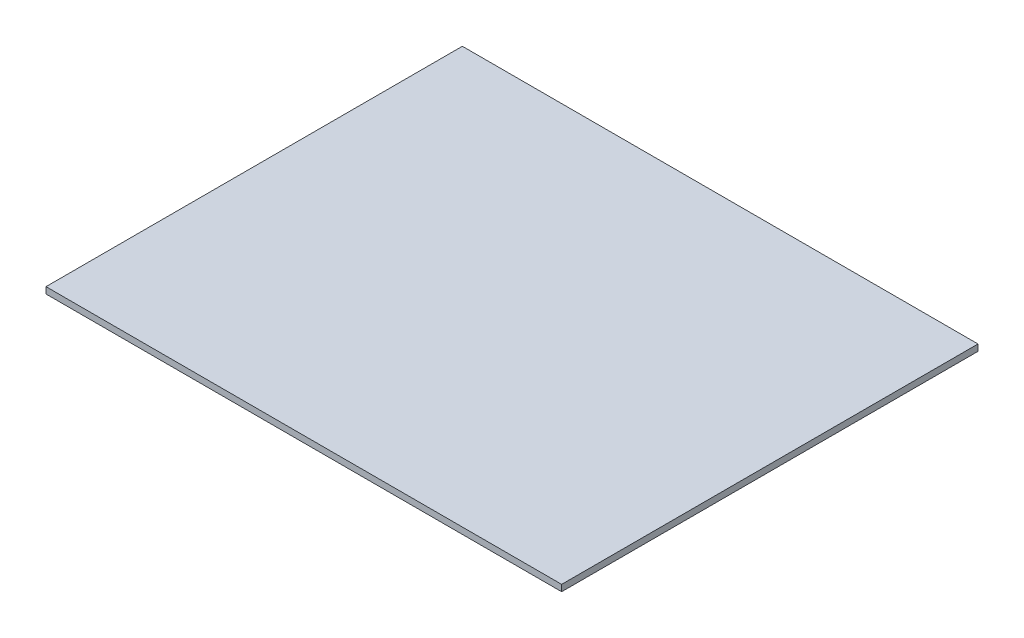
ISO-10303-21;
HEADER;
FILE_DESCRIPTION(('STEP AP214'),'2;1');
FILE_NAME('part.step','',(''),(''),'','','');
FILE_SCHEMA(('AUTOMOTIVE_DESIGN { 1 0 10303 214 1 1 1 1 }'));
ENDSEC;
DATA;
#1=APPLICATION_CONTEXT('core data for automotive mechanical design processes');
#2=APPLICATION_PROTOCOL_DEFINITION('international standard','automotive_design',2000,#1);
#3=PRODUCT_CONTEXT('',#1,'mechanical');
#4=PRODUCT('Part','Part','',(#3));
#5=PRODUCT_RELATED_PRODUCT_CATEGORY('part','',(#4));
#6=PRODUCT_DEFINITION_FORMATION('','',#4);
#7=PRODUCT_DEFINITION_CONTEXT('part definition',#1,'design');
#8=PRODUCT_DEFINITION('design','',#6,#7);
#9=PRODUCT_DEFINITION_SHAPE('','',#8);
#10=(LENGTH_UNIT() NAMED_UNIT(*) SI_UNIT(.MILLI.,.METRE.));
#11=(NAMED_UNIT(*) PLANE_ANGLE_UNIT() SI_UNIT($,.RADIAN.));
#12=(NAMED_UNIT(*) SI_UNIT($,.STERADIAN.) SOLID_ANGLE_UNIT());
#13=UNCERTAINTY_MEASURE_WITH_UNIT(LENGTH_MEASURE(1.E-05),#10,'distance_accuracy_value','');
#14=(GEOMETRIC_REPRESENTATION_CONTEXT(3) GLOBAL_UNCERTAINTY_ASSIGNED_CONTEXT((#13)) GLOBAL_UNIT_ASSIGNED_CONTEXT((#10,
#11,#12)) REPRESENTATION_CONTEXT('',''));
#15=CARTESIAN_POINT('',(0.,0.,0.));
#16=DIRECTION('',(0.,0.,1.));
#17=DIRECTION('',(1.,0.,0.));
#18=AXIS2_PLACEMENT_3D('',#15,#16,#17);
#19=CARTESIAN_POINT('',(62.5,10.,0.));
#20=DIRECTION('',(-1.,0.,0.));
#21=DIRECTION('',(0.,0.,1.));
#22=AXIS2_PLACEMENT_3D('',#19,#20,#21);
#23=PLANE('',#22);
#24=DIRECTION('',(0.,0.,-1.));
#25=VECTOR('',#24,1.);
#26=CARTESIAN_POINT('',(62.5,10.,0.));
#27=LINE('',#26,#25);
#28=CARTESIAN_POINT('',(62.5,10.,39.));
#29=VERTEX_POINT('',#28);
#30=CARTESIAN_POINT('',(62.5,10.,-47.));
#31=VERTEX_POINT('',#30);
#32=EDGE_CURVE('E180',#29,#31,#27,.T.);
#33=ORIENTED_EDGE('',*,*,#32,.F.);
#34=DIRECTION('',(0.,-1.,0.));
#35=VECTOR('',#34,1.);
#36=CARTESIAN_POINT('',(62.5,16.3245553203368,39.));
#37=LINE('',#36,#35);
#38=CARTESIAN_POINT('',(62.5,0.,39.));
#39=VERTEX_POINT('',#38);
#40=EDGE_CURVE('E186',#29,#39,#37,.T.);
#41=ORIENTED_EDGE('',*,*,#40,.T.);
#42=DIRECTION('',(0.,0.,-1.));
#43=VECTOR('',#42,1.);
#44=CARTESIAN_POINT('',(62.5,0.,0.));
#45=LINE('',#44,#43);
#46=CARTESIAN_POINT('',(62.5,0.,-47.));
#47=VERTEX_POINT('',#46);
#48=EDGE_CURVE('E137',#39,#47,#45,.T.);
#49=ORIENTED_EDGE('',*,*,#48,.T.);
#50=DIRECTION('',(0.,-1.,0.));
#51=VECTOR('',#50,1.);
#52=CARTESIAN_POINT('',(62.5,10.,-47.));
#53=LINE('',#52,#51);
#54=EDGE_CURVE('E169',#31,#47,#53,.T.);
#55=ORIENTED_EDGE('',*,*,#54,.F.);
#56=EDGE_LOOP('',(#33,#41,#49,#55));
#57=FACE_BOUND('',#56,.T.);
#58=ADVANCED_FACE('F56',(#57),#23,.F.);
#59=CARTESIAN_POINT('',(-60.5,10.,0.));
#60=DIRECTION('',(-1.,0.,0.));
#61=DIRECTION('',(0.,0.,1.));
#62=AXIS2_PLACEMENT_3D('',#59,#60,#61);
#63=PLANE('',#62);
#64=DIRECTION('',(0.,0.,-1.));
#65=VECTOR('',#64,1.);
#66=CARTESIAN_POINT('',(-60.5,10.,0.));
#67=LINE('',#66,#65);
#68=CARTESIAN_POINT('',(-60.5,10.,39.));
#69=VERTEX_POINT('',#68);
#70=CARTESIAN_POINT('',(-60.5,10.,-7.));
#71=VERTEX_POINT('',#70);
#72=EDGE_CURVE('E164',#69,#71,#67,.T.);
#73=ORIENTED_EDGE('',*,*,#72,.F.);
#74=DIRECTION('',(0.,-1.,0.));
#75=VECTOR('',#74,1.);
#76=CARTESIAN_POINT('',(-60.5,16.3245553203368,39.));
#77=LINE('',#76,#75);
#78=CARTESIAN_POINT('',(-60.5,0.,39.));
#79=VERTEX_POINT('',#78);
#80=EDGE_CURVE('E157',#69,#79,#77,.T.);
#81=ORIENTED_EDGE('',*,*,#80,.T.);
#82=DIRECTION('',(0.,0.,-1.));
#83=VECTOR('',#82,1.);
#84=CARTESIAN_POINT('',(-60.5,0.,0.));
#85=LINE('',#84,#83);
#86=CARTESIAN_POINT('',(-60.5,0.,-7.));
#87=VERTEX_POINT('',#86);
#88=EDGE_CURVE('E156',#79,#87,#85,.T.);
#89=ORIENTED_EDGE('',*,*,#88,.T.);
#90=DIRECTION('',(0.,-1.,0.));
#91=VECTOR('',#90,1.);
#92=CARTESIAN_POINT('',(-60.5,10.,-7.));
#93=LINE('',#92,#91);
#94=EDGE_CURVE('E155',#71,#87,#93,.T.);
#95=ORIENTED_EDGE('',*,*,#94,.F.);
#96=EDGE_LOOP('',(#73,#81,#89,#95));
#97=FACE_BOUND('',#96,.T.);
#98=ADVANCED_FACE('F217',(#97),#63,.F.);
#99=CARTESIAN_POINT('',(0.,10.,-7.));
#100=DIRECTION('',(0.,0.,-1.));
#101=DIRECTION('',(-1.,0.,0.));
#102=AXIS2_PLACEMENT_3D('',#99,#100,#101);
#103=PLANE('',#102);
#104=DIRECTION('',(1.,0.,0.));
#105=VECTOR('',#104,1.);
#106=CARTESIAN_POINT('',(0.,0.,-7.));
#107=LINE('',#106,#105);
#108=CARTESIAN_POINT('',(60.5,0.,-7.));
#109=VERTEX_POINT('',#108);
#110=EDGE_CURVE('E153',#87,#109,#107,.T.);
#111=ORIENTED_EDGE('',*,*,#110,.T.);
#112=DIRECTION('',(0.,-1.,0.));
#113=VECTOR('',#112,1.);
#114=CARTESIAN_POINT('',(60.5,10.,-7.));
#115=LINE('',#114,#113);
#116=CARTESIAN_POINT('',(60.5,10.,-7.));
#117=VERTEX_POINT('',#116);
#118=EDGE_CURVE('E141',#117,#109,#115,.T.);
#119=ORIENTED_EDGE('',*,*,#118,.F.);
#120=DIRECTION('',(1.,0.,0.));
#121=VECTOR('',#120,1.);
#122=CARTESIAN_POINT('',(0.,10.,-7.));
#123=LINE('',#122,#121);
#124=EDGE_CURVE('E161',#71,#117,#123,.T.);
#125=ORIENTED_EDGE('',*,*,#124,.F.);
#126=ORIENTED_EDGE('',*,*,#94,.T.);
#127=EDGE_LOOP('',(#111,#119,#125,#126));
#128=FACE_BOUND('',#127,.T.);
#129=ADVANCED_FACE('F214',(#128),#103,.F.);
#130=CARTESIAN_POINT('',(60.5,10.,0.));
#131=DIRECTION('',(-1.,0.,0.));
#132=DIRECTION('',(0.,0.,1.));
#133=AXIS2_PLACEMENT_3D('',#130,#131,#132);
#134=PLANE('',#133);
#135=DIRECTION('',(0.,-1.,0.));
#136=VECTOR('',#135,1.);
#137=CARTESIAN_POINT('',(60.5,16.3245553203368,39.));
#138=LINE('',#137,#136);
#139=CARTESIAN_POINT('',(60.5,10.,39.));
#140=VERTEX_POINT('',#139);
#141=CARTESIAN_POINT('',(60.5,0.,39.));
#142=VERTEX_POINT('',#141);
#143=EDGE_CURVE('E117',#140,#142,#138,.T.);
#144=ORIENTED_EDGE('',*,*,#143,.F.);
#145=DIRECTION('',(0.,0.,-1.));
#146=VECTOR('',#145,1.);
#147=CARTESIAN_POINT('',(60.5,10.,0.));
#148=LINE('',#147,#146);
#149=EDGE_CURVE('E159',#140,#117,#148,.T.);
#150=ORIENTED_EDGE('',*,*,#149,.T.);
#151=ORIENTED_EDGE('',*,*,#118,.T.);
#152=DIRECTION('',(0.,0.,-1.));
#153=VECTOR('',#152,1.);
#154=CARTESIAN_POINT('',(60.5,0.,0.));
#155=LINE('',#154,#153);
#156=EDGE_CURVE('E134',#142,#109,#155,.T.);
#157=ORIENTED_EDGE('',*,*,#156,.F.);
#158=EDGE_LOOP('',(#144,#150,#151,#157));
#159=FACE_BOUND('',#158,.T.);
#160=ADVANCED_FACE('F139',(#159),#134,.T.);
#161=CARTESIAN_POINT('',(-62.5,10.,0.));
#162=DIRECTION('',(-1.,0.,0.));
#163=DIRECTION('',(0.,0.,1.));
#164=AXIS2_PLACEMENT_3D('',#161,#162,#163);
#165=PLANE('',#164);
#166=DIRECTION('',(0.,-1.,0.));
#167=VECTOR('',#166,1.);
#168=CARTESIAN_POINT('',(-62.5,16.3245553203368,39.));
#169=LINE('',#168,#167);
#170=CARTESIAN_POINT('',(-62.5,10.,39.));
#171=VERTEX_POINT('',#170);
#172=CARTESIAN_POINT('',(-62.5,0.,39.));
#173=VERTEX_POINT('',#172);
#174=EDGE_CURVE('E66',#171,#173,#169,.T.);
#175=ORIENTED_EDGE('',*,*,#174,.F.);
#176=DIRECTION('',(0.,0.,-1.));
#177=VECTOR('',#176,1.);
#178=CARTESIAN_POINT('',(-62.5,10.,0.));
#179=LINE('',#178,#177);
#180=CARTESIAN_POINT('',(-62.5,10.,-47.));
#181=VERTEX_POINT('',#180);
#182=EDGE_CURVE('E193',#171,#181,#179,.T.);
#183=ORIENTED_EDGE('',*,*,#182,.T.);
#184=DIRECTION('',(0.,-1.,0.));
#185=VECTOR('',#184,1.);
#186=CARTESIAN_POINT('',(-62.5,10.,-47.));
#187=LINE('',#186,#185);
#188=CARTESIAN_POINT('',(-62.5,0.,-47.));
#189=VERTEX_POINT('',#188);
#190=EDGE_CURVE('E170',#181,#189,#187,.T.);
#191=ORIENTED_EDGE('',*,*,#190,.T.);
#192=DIRECTION('',(0.,0.,-1.));
#193=VECTOR('',#192,1.);
#194=CARTESIAN_POINT('',(-62.5,0.,0.));
#195=LINE('',#194,#193);
#196=EDGE_CURVE('E60',#173,#189,#195,.T.);
#197=ORIENTED_EDGE('',*,*,#196,.F.);
#198=EDGE_LOOP('',(#175,#183,#191,#197));
#199=FACE_BOUND('',#198,.T.);
#200=ADVANCED_FACE('F58',(#199),#165,.T.);
#201=CARTESIAN_POINT('',(0.,10.,-47.));
#202=DIRECTION('',(0.,0.,-1.));
#203=DIRECTION('',(-1.,0.,0.));
#204=AXIS2_PLACEMENT_3D('',#201,#202,#203);
#205=PLANE('',#204);
#206=DIRECTION('',(1.,0.,0.));
#207=VECTOR('',#206,1.);
#208=CARTESIAN_POINT('',(0.,0.,-47.));
#209=LINE('',#208,#207);
#210=EDGE_CURVE('E144',#189,#47,#209,.T.);
#211=ORIENTED_EDGE('',*,*,#210,.F.);
#212=ORIENTED_EDGE('',*,*,#190,.F.);
#213=DIRECTION('',(1.,0.,0.));
#214=VECTOR('',#213,1.);
#215=CARTESIAN_POINT('',(0.,10.,-47.));
#216=LINE('',#215,#214);
#217=EDGE_CURVE('E166',#181,#31,#216,.T.);
#218=ORIENTED_EDGE('',*,*,#217,.T.);
#219=ORIENTED_EDGE('',*,*,#54,.T.);
#220=EDGE_LOOP('',(#211,#212,#218,#219));
#221=FACE_BOUND('',#220,.T.);
#222=ADVANCED_FACE('F200',(#221),#205,.T.);
#223=CARTESIAN_POINT('',(0.,10.,0.));
#224=DIRECTION('',(0.,1.,0.));
#225=DIRECTION('',(0.,0.,1.));
#226=AXIS2_PLACEMENT_3D('',#223,#224,#225);
#227=PLANE('',#226);
#228=DIRECTION('',(1.,0.,0.));
#229=VECTOR('',#228,1.);
#230=CARTESIAN_POINT('',(-60.5,10.,39.));
#231=LINE('',#230,#229);
#232=EDGE_CURVE('E75',#171,#69,#231,.T.);
#233=ORIENTED_EDGE('',*,*,#232,.T.);
#234=ORIENTED_EDGE('',*,*,#72,.T.);
#235=ORIENTED_EDGE('',*,*,#124,.T.);
#236=ORIENTED_EDGE('',*,*,#149,.F.);
#237=DIRECTION('',(1.,0.,0.));
#238=VECTOR('',#237,1.);
#239=CARTESIAN_POINT('',(60.5,10.,39.));
#240=LINE('',#239,#238);
#241=EDGE_CURVE('E123',#140,#29,#240,.T.);
#242=ORIENTED_EDGE('',*,*,#241,.T.);
#243=ORIENTED_EDGE('',*,*,#32,.T.);
#244=ORIENTED_EDGE('',*,*,#217,.F.);
#245=ORIENTED_EDGE('',*,*,#182,.F.);
#246=EDGE_LOOP('',(#233,#234,#235,#236,#242,#243,#244,#245));
#247=FACE_BOUND('',#246,.T.);
#248=ADVANCED_FACE('F220',(#247),#227,.T.);
#249=CARTESIAN_POINT('',(0.,0.,0.));
#250=DIRECTION('',(0.,1.,0.));
#251=DIRECTION('',(0.,0.,1.));
#252=AXIS2_PLACEMENT_3D('',#249,#250,#251);
#253=PLANE('',#252);
#254=CARTESIAN_POINT('',(50.,0.,-35.));
#255=DIRECTION('',(0.,1.,0.));
#256=DIRECTION('',(0.,0.,-1.));
#257=AXIS2_PLACEMENT_3D('',#254,#255,#256);
#258=CIRCLE('',#257,3.5);
#259=CARTESIAN_POINT('',(50.,0.,-38.5));
#260=VERTEX_POINT('',#259);
#261=EDGE_CURVE('E177',#260,#260,#258,.T.);
#262=ORIENTED_EDGE('',*,*,#261,.T.);
#263=EDGE_LOOP('',(#262));
#264=FACE_BOUND('',#263,.T.);
#265=CARTESIAN_POINT('',(-50.,0.,-35.));
#266=DIRECTION('',(0.,1.,0.));
#267=DIRECTION('',(0.,0.,1.));
#268=AXIS2_PLACEMENT_3D('',#265,#266,#267);
#269=CIRCLE('',#268,3.5);
#270=CARTESIAN_POINT('',(-50.,0.,-31.5));
#271=VERTEX_POINT('',#270);
#272=EDGE_CURVE('E143',#271,#271,#269,.F.);
#273=ORIENTED_EDGE('',*,*,#272,.F.);
#274=EDGE_LOOP('',(#273));
#275=FACE_BOUND('',#274,.T.);
#276=ORIENTED_EDGE('',*,*,#88,.F.);
#277=DIRECTION('',(1.,0.,0.));
#278=VECTOR('',#277,1.);
#279=CARTESIAN_POINT('',(-60.5,0.,39.));
#280=LINE('',#279,#278);
#281=EDGE_CURVE('E12',#173,#79,#280,.T.);
#282=ORIENTED_EDGE('',*,*,#281,.F.);
#283=ORIENTED_EDGE('',*,*,#196,.T.);
#284=ORIENTED_EDGE('',*,*,#210,.T.);
#285=ORIENTED_EDGE('',*,*,#48,.F.);
#286=DIRECTION('',(1.,0.,0.));
#287=VECTOR('',#286,1.);
#288=CARTESIAN_POINT('',(60.5,0.,39.));
#289=LINE('',#288,#287);
#290=EDGE_CURVE('E120',#142,#39,#289,.T.);
#291=ORIENTED_EDGE('',*,*,#290,.F.);
#292=ORIENTED_EDGE('',*,*,#156,.T.);
#293=ORIENTED_EDGE('',*,*,#110,.F.);
#294=EDGE_LOOP('',(#276,#282,#283,#284,#285,#291,#292,#293));
#295=FACE_BOUND('',#294,.T.);
#296=ADVANCED_FACE('F132',(#264,#275,#295),#253,.F.);
#297=CARTESIAN_POINT('',(-50.,-4.2,-35.));
#298=DIRECTION('',(0.,1.,0.));
#299=DIRECTION('',(0.,0.,1.));
#300=AXIS2_PLACEMENT_3D('',#297,#298,#299);
#301=CYLINDRICAL_SURFACE('',#300,3.5);
#302=CARTESIAN_POINT('',(-50.,-4.2,-35.));
#303=DIRECTION('',(0.,-1.,0.));
#304=DIRECTION('',(0.,0.,-1.));
#305=AXIS2_PLACEMENT_3D('',#302,#303,#304);
#306=CIRCLE('',#305,3.5);
#307=CARTESIAN_POINT('',(-50.,-4.2,-38.5));
#308=VERTEX_POINT('',#307);
#309=EDGE_CURVE('E171',#308,#308,#306,.T.);
#310=ORIENTED_EDGE('',*,*,#309,.F.);
#311=EDGE_LOOP('',(#310));
#312=FACE_BOUND('',#311,.T.);
#313=ORIENTED_EDGE('',*,*,#272,.T.);
#314=EDGE_LOOP('',(#313));
#315=FACE_BOUND('',#314,.T.);
#316=ADVANCED_FACE('F227',(#312,#315),#301,.T.);
#317=CARTESIAN_POINT('',(-50.,2.94142842854285,-35.));
#318=DIRECTION('',(0.,-1.,0.));
#319=DIRECTION('',(-1.,0.,0.));
#320=AXIS2_PLACEMENT_3D('',#317,#318,#319);
#321=SPHERICAL_SURFACE('',#320,10.);
#322=CARTESIAN_POINT('',(-50.,-4.2,-35.));
#323=DIRECTION('',(0.,-1.,0.));
#324=DIRECTION('',(0.,0.,-1.));
#325=AXIS2_PLACEMENT_3D('',#322,#323,#324);
#326=CIRCLE('',#325,7.);
#327=CARTESIAN_POINT('',(-50.,-4.2,-42.));
#328=VERTEX_POINT('',#327);
#329=EDGE_CURVE('E147',#328,#328,#326,.T.);
#330=ORIENTED_EDGE('',*,*,#329,.T.);
#331=EDGE_LOOP('',(#330));
#332=FACE_BOUND('',#331,.T.);
#333=ADVANCED_FACE('F246',(#332),#321,.T.);
#334=CARTESIAN_POINT('',(0.,-4.2,-35.));
#335=DIRECTION('',(0.,-1.,0.));
#336=DIRECTION('',(0.,0.,-1.));
#337=AXIS2_PLACEMENT_3D('',#334,#335,#336);
#338=PLANE('',#337);
#339=ORIENTED_EDGE('',*,*,#309,.T.);
#340=EDGE_LOOP('',(#339));
#341=FACE_BOUND('',#340,.T.);
#342=ORIENTED_EDGE('',*,*,#329,.F.);
#343=EDGE_LOOP('',(#342));
#344=FACE_BOUND('',#343,.T.);
#345=ADVANCED_FACE('F250',(#341,#344),#338,.F.);
#346=CARTESIAN_POINT('',(50.,-4.2,-35.));
#347=DIRECTION('',(0.,1.,0.));
#348=DIRECTION('',(0.,0.,1.));
#349=AXIS2_PLACEMENT_3D('',#346,#347,#348);
#350=CYLINDRICAL_SURFACE('',#349,3.5);
#351=CARTESIAN_POINT('',(50.,-4.2,-35.));
#352=DIRECTION('',(0.,-1.,0.));
#353=DIRECTION('',(0.,0.,-1.));
#354=AXIS2_PLACEMENT_3D('',#351,#352,#353);
#355=CIRCLE('',#354,3.5);
#356=CARTESIAN_POINT('',(50.,-4.2,-38.5));
#357=VERTEX_POINT('',#356);
#358=EDGE_CURVE('E174',#357,#357,#355,.F.);
#359=ORIENTED_EDGE('',*,*,#358,.T.);
#360=EDGE_LOOP('',(#359));
#361=FACE_BOUND('',#360,.T.);
#362=ORIENTED_EDGE('',*,*,#261,.F.);
#363=EDGE_LOOP('',(#362));
#364=FACE_BOUND('',#363,.T.);
#365=ADVANCED_FACE('F254',(#361,#364),#350,.T.);
#366=CARTESIAN_POINT('',(50.,2.94142842854285,-35.));
#367=DIRECTION('',(0.,-1.,0.));
#368=DIRECTION('',(1.,0.,0.));
#369=AXIS2_PLACEMENT_3D('',#366,#367,#368);
#370=SPHERICAL_SURFACE('',#369,10.);
#371=CARTESIAN_POINT('',(50.,-4.2,-35.));
#372=DIRECTION('',(0.,1.,0.));
#373=DIRECTION('',(0.,0.,-1.));
#374=AXIS2_PLACEMENT_3D('',#371,#372,#373);
#375=CIRCLE('',#374,7.);
#376=CARTESIAN_POINT('',(50.,-4.2,-42.));
#377=VERTEX_POINT('',#376);
#378=EDGE_CURVE('E127',#377,#377,#375,.T.);
#379=ORIENTED_EDGE('',*,*,#378,.F.);
#380=EDGE_LOOP('',(#379));
#381=FACE_BOUND('',#380,.T.);
#382=ADVANCED_FACE('F258',(#381),#370,.T.);
#383=CARTESIAN_POINT('',(0.,-4.2,-35.));
#384=DIRECTION('',(0.,-1.,0.));
#385=DIRECTION('',(0.,0.,-1.));
#386=AXIS2_PLACEMENT_3D('',#383,#384,#385);
#387=PLANE('',#386);
#388=ORIENTED_EDGE('',*,*,#358,.F.);
#389=EDGE_LOOP('',(#388));
#390=FACE_BOUND('',#389,.T.);
#391=ORIENTED_EDGE('',*,*,#378,.T.);
#392=EDGE_LOOP('',(#391));
#393=FACE_BOUND('',#392,.T.);
#394=ADVANCED_FACE('F262',(#390,#393),#387,.F.);
#395=CARTESIAN_POINT('',(60.5,16.3245553203368,39.));
#396=DIRECTION('',(0.,0.,-1.));
#397=DIRECTION('',(-1.,0.,0.));
#398=AXIS2_PLACEMENT_3D('',#395,#396,#397);
#399=PLANE('',#398);
#400=ORIENTED_EDGE('',*,*,#143,.T.);
#401=ORIENTED_EDGE('',*,*,#290,.T.);
#402=ORIENTED_EDGE('',*,*,#40,.F.);
#403=ORIENTED_EDGE('',*,*,#241,.F.);
#404=EDGE_LOOP('',(#400,#401,#402,#403));
#405=FACE_BOUND('',#404,.T.);
#406=ADVANCED_FACE('F119',(#405),#399,.F.);
#407=CARTESIAN_POINT('',(-60.5,16.3245553203368,39.));
#408=DIRECTION('',(0.,0.,-1.));
#409=DIRECTION('',(-1.,0.,0.));
#410=AXIS2_PLACEMENT_3D('',#407,#408,#409);
#411=PLANE('',#410);
#412=ORIENTED_EDGE('',*,*,#174,.T.);
#413=ORIENTED_EDGE('',*,*,#281,.T.);
#414=ORIENTED_EDGE('',*,*,#80,.F.);
#415=ORIENTED_EDGE('',*,*,#232,.F.);
#416=EDGE_LOOP('',(#412,#413,#414,#415));
#417=FACE_BOUND('',#416,.T.);
#418=ADVANCED_FACE('F218',(#417),#411,.F.);
#419=CLOSED_SHELL('',(#58,#98,#129,#160,#200,#222,#248,#296,#316,#333,#345,#365,#382,#394,#406,#418));
#420=MANIFOLD_SOLID_BREP('B2',#419);
#421=CARTESIAN_POINT('',(-400000.,12.,-64.9999999999409));
#422=DIRECTION('',(0.,0.,1.));
#423=DIRECTION('',(1.,0.,0.));
#424=AXIS2_PLACEMENT_3D('',#421,#422,#423);
#425=PLANE('',#424);
#426=DIRECTION('',(-1.,0.,0.));
#427=VECTOR('',#426,1.);
#428=CARTESIAN_POINT('',(-400000.,10.,-64.9999999999409));
#429=LINE('',#428,#427);
#430=CARTESIAN_POINT('',(80.4999999999723,10.,-64.9999999999977));
#431=VERTEX_POINT('',#430);
#432=CARTESIAN_POINT('',(-80.4999999999723,10.,-64.9999999999977));
#433=VERTEX_POINT('',#432);
#434=EDGE_CURVE('E446',#431,#433,#429,.T.);
#435=ORIENTED_EDGE('',*,*,#434,.T.);
#436=DIRECTION('',(0.,-1.,0.));
#437=VECTOR('',#436,1.);
#438=CARTESIAN_POINT('',(-80.4999999999723,12.,-64.9999999999977));
#439=LINE('',#438,#437);
#440=CARTESIAN_POINT('',(-80.4999999999723,12.,-64.9999999999977));
#441=VERTEX_POINT('',#440);
#442=EDGE_CURVE('E54',#441,#433,#439,.T.);
#443=ORIENTED_EDGE('',*,*,#442,.F.);
#444=DIRECTION('',(-1.,0.,0.));
#445=VECTOR('',#444,1.);
#446=CARTESIAN_POINT('',(-400000.,12.,-64.9999999999409));
#447=LINE('',#446,#445);
#448=CARTESIAN_POINT('',(80.4999999999723,12.,-64.9999999999977));
#449=VERTEX_POINT('',#448);
#450=EDGE_CURVE('E432',#449,#441,#447,.T.);
#451=ORIENTED_EDGE('',*,*,#450,.F.);
#452=DIRECTION('',(0.,-1.,0.));
#453=VECTOR('',#452,1.);
#454=CARTESIAN_POINT('',(80.4999999999723,12.,-64.9999999999977));
#455=LINE('',#454,#453);
#456=EDGE_CURVE('E399',#449,#431,#455,.T.);
#457=ORIENTED_EDGE('',*,*,#456,.T.);
#458=EDGE_LOOP('',(#435,#443,#451,#457));
#459=FACE_BOUND('',#458,.T.);
#460=ADVANCED_FACE('F383',(#459),#425,.F.);
#461=CARTESIAN_POINT('',(-80.4999999999723,12.,291548.3));
#462=DIRECTION('',(1.,0.,0.));
#463=DIRECTION('',(0.,0.,-1.));
#464=AXIS2_PLACEMENT_3D('',#461,#462,#463);
#465=PLANE('',#464);
#466=DIRECTION('',(0.,0.,1.));
#467=VECTOR('',#466,1.);
#468=CARTESIAN_POINT('',(-80.4999999999723,10.,291548.3));
#469=LINE('',#468,#467);
#470=CARTESIAN_POINT('',(-80.4999999999723,10.,64.9999999999977));
#471=VERTEX_POINT('',#470);
#472=EDGE_CURVE('E437',#433,#471,#469,.T.);
#473=ORIENTED_EDGE('',*,*,#472,.T.);
#474=DIRECTION('',(0.,-1.,0.));
#475=VECTOR('',#474,1.);
#476=CARTESIAN_POINT('',(-80.4999999999723,12.,64.9999999999977));
#477=LINE('',#476,#475);
#478=CARTESIAN_POINT('',(-80.4999999999723,12.,64.9999999999977));
#479=VERTEX_POINT('',#478);
#480=EDGE_CURVE('E391',#479,#471,#477,.T.);
#481=ORIENTED_EDGE('',*,*,#480,.F.);
#482=DIRECTION('',(0.,0.,1.));
#483=VECTOR('',#482,1.);
#484=CARTESIAN_POINT('',(-80.4999999999723,12.,291548.3));
#485=LINE('',#484,#483);
#486=EDGE_CURVE('E424',#441,#479,#485,.T.);
#487=ORIENTED_EDGE('',*,*,#486,.F.);
#488=ORIENTED_EDGE('',*,*,#442,.T.);
#489=EDGE_LOOP('',(#473,#481,#487,#488));
#490=FACE_BOUND('',#489,.T.);
#491=ADVANCED_FACE('F436',(#490),#465,.F.);
#492=CARTESIAN_POINT('',(-400000.,12.,64.9999999999977));
#493=DIRECTION('',(0.,0.,1.));
#494=DIRECTION('',(1.,0.,0.));
#495=AXIS2_PLACEMENT_3D('',#492,#493,#494);
#496=PLANE('',#495);
#497=DIRECTION('',(-1.,0.,0.));
#498=VECTOR('',#497,1.);
#499=CARTESIAN_POINT('',(-400000.,10.,64.9999999999977));
#500=LINE('',#499,#498);
#501=CARTESIAN_POINT('',(80.4999999999723,10.,64.9999999999977));
#502=VERTEX_POINT('',#501);
#503=EDGE_CURVE('E449',#502,#471,#500,.T.);
#504=ORIENTED_EDGE('',*,*,#503,.F.);
#505=DIRECTION('',(0.,-1.,0.));
#506=VECTOR('',#505,1.);
#507=CARTESIAN_POINT('',(80.4999999999723,12.,64.9999999999977));
#508=LINE('',#507,#506);
#509=CARTESIAN_POINT('',(80.4999999999723,12.,64.9999999999977));
#510=VERTEX_POINT('',#509);
#511=EDGE_CURVE('E413',#510,#502,#508,.T.);
#512=ORIENTED_EDGE('',*,*,#511,.F.);
#513=DIRECTION('',(-1.,0.,0.));
#514=VECTOR('',#513,1.);
#515=CARTESIAN_POINT('',(-400000.,12.,64.9999999999977));
#516=LINE('',#515,#514);
#517=EDGE_CURVE('E431',#510,#479,#516,.T.);
#518=ORIENTED_EDGE('',*,*,#517,.T.);
#519=ORIENTED_EDGE('',*,*,#480,.T.);
#520=EDGE_LOOP('',(#504,#512,#518,#519));
#521=FACE_BOUND('',#520,.T.);
#522=ADVANCED_FACE('F440',(#521),#496,.T.);
#523=CARTESIAN_POINT('',(80.4999999999723,12.,291548.3));
#524=DIRECTION('',(1.,0.,0.));
#525=DIRECTION('',(0.,0.,-1.));
#526=AXIS2_PLACEMENT_3D('',#523,#524,#525);
#527=PLANE('',#526);
#528=DIRECTION('',(0.,0.,1.));
#529=VECTOR('',#528,1.);
#530=CARTESIAN_POINT('',(80.4999999999723,10.,291548.3));
#531=LINE('',#530,#529);
#532=EDGE_CURVE('E451',#431,#502,#531,.T.);
#533=ORIENTED_EDGE('',*,*,#532,.F.);
#534=ORIENTED_EDGE('',*,*,#456,.F.);
#535=DIRECTION('',(0.,0.,1.));
#536=VECTOR('',#535,1.);
#537=CARTESIAN_POINT('',(80.4999999999723,12.,291548.3));
#538=LINE('',#537,#536);
#539=EDGE_CURVE('E441',#449,#510,#538,.T.);
#540=ORIENTED_EDGE('',*,*,#539,.T.);
#541=ORIENTED_EDGE('',*,*,#511,.T.);
#542=EDGE_LOOP('',(#533,#534,#540,#541));
#543=FACE_BOUND('',#542,.T.);
#544=ADVANCED_FACE('F457',(#543),#527,.T.);
#545=CARTESIAN_POINT('',(0.,12.,0.));
#546=DIRECTION('',(0.,1.,0.));
#547=DIRECTION('',(0.,0.,1.));
#548=AXIS2_PLACEMENT_3D('',#545,#546,#547);
#549=PLANE('',#548);
#550=ORIENTED_EDGE('',*,*,#450,.T.);
#551=ORIENTED_EDGE('',*,*,#486,.T.);
#552=ORIENTED_EDGE('',*,*,#517,.F.);
#553=ORIENTED_EDGE('',*,*,#539,.F.);
#554=EDGE_LOOP('',(#550,#551,#552,#553));
#555=FACE_BOUND('',#554,.T.);
#556=ADVANCED_FACE('F428',(#555),#549,.T.);
#557=CARTESIAN_POINT('',(0.,10.,0.));
#558=DIRECTION('',(0.,1.,0.));
#559=DIRECTION('',(0.,0.,1.));
#560=AXIS2_PLACEMENT_3D('',#557,#558,#559);
#561=PLANE('',#560);
#562=ORIENTED_EDGE('',*,*,#434,.F.);
#563=ORIENTED_EDGE('',*,*,#532,.T.);
#564=ORIENTED_EDGE('',*,*,#503,.T.);
#565=ORIENTED_EDGE('',*,*,#472,.F.);
#566=EDGE_LOOP('',(#562,#563,#564,#565));
#567=FACE_BOUND('',#566,.T.);
#568=ADVANCED_FACE('F456',(#567),#561,.F.);
#569=CLOSED_SHELL('',(#460,#491,#522,#544,#556,#568));
#570=MANIFOLD_SOLID_BREP('B6',#569);
#571=CARTESIAN_POINT('',(0.,10.,47.));
#572=DIRECTION('',(0.,0.,-1.));
#573=DIRECTION('',(-1.,0.,0.));
#574=AXIS2_PLACEMENT_3D('',#571,#572,#573);
#575=PLANE('',#574);
#576=DIRECTION('',(1.,0.,0.));
#577=VECTOR('',#576,1.);
#578=CARTESIAN_POINT('',(0.,0.,47.));
#579=LINE('',#578,#577);
#580=CARTESIAN_POINT('',(-62.5,0.,47.));
#581=VERTEX_POINT('',#580);
#582=CARTESIAN_POINT('',(62.5,0.,47.));
#583=VERTEX_POINT('',#582);
#584=EDGE_CURVE('E543',#581,#583,#579,.T.);
#585=ORIENTED_EDGE('',*,*,#584,.T.);
#586=DIRECTION('',(0.,-1.,0.));
#587=VECTOR('',#586,1.);
#588=CARTESIAN_POINT('',(62.5,10.,47.));
#589=LINE('',#588,#587);
#590=CARTESIAN_POINT('',(62.5,10.,47.));
#591=VERTEX_POINT('',#590);
#592=EDGE_CURVE('E515',#591,#583,#589,.T.);
#593=ORIENTED_EDGE('',*,*,#592,.F.);
#594=DIRECTION('',(1.,0.,0.));
#595=VECTOR('',#594,1.);
#596=CARTESIAN_POINT('',(0.,10.,47.));
#597=LINE('',#596,#595);
#598=CARTESIAN_POINT('',(-62.5,10.,47.));
#599=VERTEX_POINT('',#598);
#600=EDGE_CURVE('E531',#599,#591,#597,.T.);
#601=ORIENTED_EDGE('',*,*,#600,.F.);
#602=DIRECTION('',(0.,-1.,0.));
#603=VECTOR('',#602,1.);
#604=CARTESIAN_POINT('',(-62.5,10.,47.));
#605=LINE('',#604,#603);
#606=EDGE_CURVE('E381',#599,#581,#605,.T.);
#607=ORIENTED_EDGE('',*,*,#606,.T.);
#608=EDGE_LOOP('',(#585,#593,#601,#607));
#609=FACE_BOUND('',#608,.T.);
#610=ADVANCED_FACE('F507',(#609),#575,.F.);
#611=CARTESIAN_POINT('',(0.,10.,0.));
#612=DIRECTION('',(0.,1.,0.));
#613=DIRECTION('',(0.,0.,1.));
#614=AXIS2_PLACEMENT_3D('',#611,#612,#613);
#615=PLANE('',#614);
#616=DIRECTION('',(1.,0.,0.));
#617=VECTOR('',#616,1.);
#618=CARTESIAN_POINT('',(0.,10.,45.));
#619=LINE('',#618,#617);
#620=CARTESIAN_POINT('',(-62.5,10.,45.));
#621=VERTEX_POINT('',#620);
#622=CARTESIAN_POINT('',(62.5,10.,45.));
#623=VERTEX_POINT('',#622);
#624=EDGE_CURVE('E555',#621,#623,#619,.T.);
#625=ORIENTED_EDGE('',*,*,#624,.F.);
#626=DIRECTION('',(0.,0.,-1.));
#627=VECTOR('',#626,1.);
#628=CARTESIAN_POINT('',(-62.5,10.,0.));
#629=LINE('',#628,#627);
#630=EDGE_CURVE('E558',#599,#621,#629,.T.);
#631=ORIENTED_EDGE('',*,*,#630,.F.);
#632=ORIENTED_EDGE('',*,*,#600,.T.);
#633=DIRECTION('',(0.,0.,-1.));
#634=VECTOR('',#633,1.);
#635=CARTESIAN_POINT('',(62.5,10.,0.));
#636=LINE('',#635,#634);
#637=EDGE_CURVE('E554',#591,#623,#636,.T.);
#638=ORIENTED_EDGE('',*,*,#637,.T.);
#639=EDGE_LOOP('',(#625,#631,#632,#638));
#640=FACE_BOUND('',#639,.T.);
#641=ADVANCED_FACE('F581',(#640),#615,.T.);
#642=CARTESIAN_POINT('',(0.,0.,0.));
#643=DIRECTION('',(0.,1.,0.));
#644=DIRECTION('',(0.,0.,1.));
#645=AXIS2_PLACEMENT_3D('',#642,#643,#644);
#646=PLANE('',#645);
#647=DIRECTION('',(0.,0.,-1.));
#648=VECTOR('',#647,1.);
#649=CARTESIAN_POINT('',(-62.5,0.,0.));
#650=LINE('',#649,#648);
#651=CARTESIAN_POINT('',(-62.5,0.,45.));
#652=VERTEX_POINT('',#651);
#653=EDGE_CURVE('E548',#581,#652,#650,.T.);
#654=ORIENTED_EDGE('',*,*,#653,.T.);
#655=DIRECTION('',(1.,0.,0.));
#656=VECTOR('',#655,1.);
#657=CARTESIAN_POINT('',(0.,0.,45.));
#658=LINE('',#657,#656);
#659=CARTESIAN_POINT('',(62.5,0.,45.));
#660=VERTEX_POINT('',#659);
#661=EDGE_CURVE('E522',#652,#660,#658,.T.);
#662=ORIENTED_EDGE('',*,*,#661,.T.);
#663=DIRECTION('',(0.,0.,-1.));
#664=VECTOR('',#663,1.);
#665=CARTESIAN_POINT('',(62.5,0.,0.));
#666=LINE('',#665,#664);
#667=EDGE_CURVE('E547',#583,#660,#666,.T.);
#668=ORIENTED_EDGE('',*,*,#667,.F.);
#669=ORIENTED_EDGE('',*,*,#584,.F.);
#670=EDGE_LOOP('',(#654,#662,#668,#669));
#671=FACE_BOUND('',#670,.T.);
#672=ADVANCED_FACE('F556',(#671),#646,.F.);
#673=CARTESIAN_POINT('',(0.,10.,45.));
#674=DIRECTION('',(0.,0.,-1.));
#675=DIRECTION('',(-1.,0.,0.));
#676=AXIS2_PLACEMENT_3D('',#673,#674,#675);
#677=PLANE('',#676);
#678=ORIENTED_EDGE('',*,*,#661,.F.);
#679=DIRECTION('',(0.,-1.,0.));
#680=VECTOR('',#679,1.);
#681=CARTESIAN_POINT('',(-62.5,16.3245553203368,45.));
#682=LINE('',#681,#680);
#683=EDGE_CURVE('E562',#621,#652,#682,.T.);
#684=ORIENTED_EDGE('',*,*,#683,.F.);
#685=ORIENTED_EDGE('',*,*,#624,.T.);
#686=DIRECTION('',(0.,-1.,0.));
#687=VECTOR('',#686,1.);
#688=CARTESIAN_POINT('',(62.5,16.3245553203368,45.));
#689=LINE('',#688,#687);
#690=EDGE_CURVE('E569',#623,#660,#689,.T.);
#691=ORIENTED_EDGE('',*,*,#690,.T.);
#692=EDGE_LOOP('',(#678,#684,#685,#691));
#693=FACE_BOUND('',#692,.T.);
#694=ADVANCED_FACE('F577',(#693),#677,.T.);
#695=CARTESIAN_POINT('',(62.5,10.,0.));
#696=DIRECTION('',(-1.,0.,0.));
#697=DIRECTION('',(0.,0.,1.));
#698=AXIS2_PLACEMENT_3D('',#695,#696,#697);
#699=PLANE('',#698);
#700=ORIENTED_EDGE('',*,*,#667,.T.);
#701=ORIENTED_EDGE('',*,*,#690,.F.);
#702=ORIENTED_EDGE('',*,*,#637,.F.);
#703=ORIENTED_EDGE('',*,*,#592,.T.);
#704=EDGE_LOOP('',(#700,#701,#702,#703));
#705=FACE_BOUND('',#704,.T.);
#706=ADVANCED_FACE('F552',(#705),#699,.F.);
#707=CARTESIAN_POINT('',(-62.5,10.,0.));
#708=DIRECTION('',(-1.,0.,0.));
#709=DIRECTION('',(0.,0.,1.));
#710=AXIS2_PLACEMENT_3D('',#707,#708,#709);
#711=PLANE('',#710);
#712=ORIENTED_EDGE('',*,*,#683,.T.);
#713=ORIENTED_EDGE('',*,*,#653,.F.);
#714=ORIENTED_EDGE('',*,*,#606,.F.);
#715=ORIENTED_EDGE('',*,*,#630,.T.);
#716=EDGE_LOOP('',(#712,#713,#714,#715));
#717=FACE_BOUND('',#716,.T.);
#718=ADVANCED_FACE('F509',(#717),#711,.T.);
#719=CLOSED_SHELL('',(#610,#641,#672,#694,#706,#718));
#720=MANIFOLD_SOLID_BREP('B48',#719);
#721=ADVANCED_BREP_SHAPE_REPRESENTATION('',(#18,#420,#570,#720),#14);
#722=SHAPE_DEFINITION_REPRESENTATION(#9,#721);
ENDSEC;
END-ISO-10303-21;
